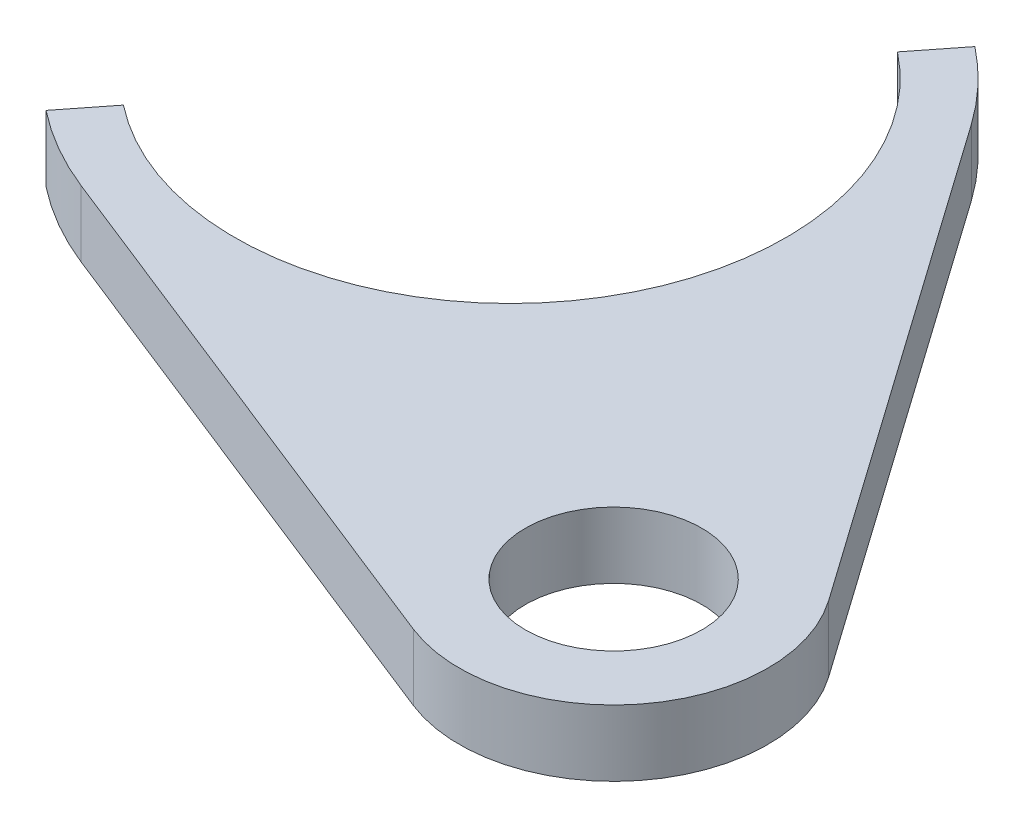
ISO-10303-21;
HEADER;
FILE_DESCRIPTION(('STEP AP214'),'2;1');
FILE_NAME('part.step','',(''),(''),'','','');
FILE_SCHEMA(('AUTOMOTIVE_DESIGN { 1 0 10303 214 1 1 1 1 }'));
ENDSEC;
DATA;
#1=APPLICATION_CONTEXT('core data for automotive mechanical design processes');
#2=APPLICATION_PROTOCOL_DEFINITION('international standard','automotive_design',2000,#1);
#3=PRODUCT_CONTEXT('',#1,'mechanical');
#4=PRODUCT('Part','Part','',(#3));
#5=PRODUCT_RELATED_PRODUCT_CATEGORY('part','',(#4));
#6=PRODUCT_DEFINITION_FORMATION('','',#4);
#7=PRODUCT_DEFINITION_CONTEXT('part definition',#1,'design');
#8=PRODUCT_DEFINITION('design','',#6,#7);
#9=PRODUCT_DEFINITION_SHAPE('','',#8);
#10=(LENGTH_UNIT() NAMED_UNIT(*) SI_UNIT(.MILLI.,.METRE.));
#11=(NAMED_UNIT(*) PLANE_ANGLE_UNIT() SI_UNIT($,.RADIAN.));
#12=(NAMED_UNIT(*) SI_UNIT($,.STERADIAN.) SOLID_ANGLE_UNIT());
#13=UNCERTAINTY_MEASURE_WITH_UNIT(LENGTH_MEASURE(1.E-05),#10,'distance_accuracy_value','');
#14=(GEOMETRIC_REPRESENTATION_CONTEXT(3) GLOBAL_UNCERTAINTY_ASSIGNED_CONTEXT((#13)) GLOBAL_UNIT_ASSIGNED_CONTEXT((#10,
#11,#12)) REPRESENTATION_CONTEXT('',''));
#15=CARTESIAN_POINT('',(0.,0.,0.));
#16=DIRECTION('',(0.,0.,1.));
#17=DIRECTION('',(1.,0.,0.));
#18=AXIS2_PLACEMENT_3D('',#15,#16,#17);
#19=CARTESIAN_POINT('',(-1685.3,3.,117.9));
#20=DIRECTION('',(0.,1.,0.));
#21=DIRECTION('',(0.,0.,1.));
#22=AXIS2_PLACEMENT_3D('',#19,#20,#21);
#23=PLANE('',#22);
#24=CARTESIAN_POINT('',(-1685.3,3.,117.9));
#25=DIRECTION('',(0.,-1.,0.));
#26=DIRECTION('',(0.,0.,1.));
#27=AXIS2_PLACEMENT_3D('',#24,#25,#26);
#28=CIRCLE('',#27,12.5);
#29=CARTESIAN_POINT('',(-1677.56763032335,3.,108.078571428571));
#30=VERTEX_POINT('',#29);
#31=CARTESIAN_POINT('',(-1693.03236967665,3.,127.721428571429));
#32=VERTEX_POINT('',#31);
#33=EDGE_CURVE('E146',#30,#32,#28,.T.);
#34=ORIENTED_EDGE('',*,*,#33,.T.);
#35=DIRECTION('',(-0.618589574131775,0.,0.78571428571426));
#36=VECTOR('',#35,1.);
#37=CARTESIAN_POINT('',(-1694.57884361198,3.,129.685714285714));
#38=LINE('',#37,#36);
#39=CARTESIAN_POINT('',(-1694.57884361198,3.,129.685714285714));
#40=VERTEX_POINT('',#39);
#41=EDGE_CURVE('E94',#32,#40,#38,.T.);
#42=ORIENTED_EDGE('',*,*,#41,.T.);
#43=CARTESIAN_POINT('',(-1685.3,3.,117.9));
#44=DIRECTION('',(0.,1.,0.));
#45=DIRECTION('',(0.,0.,1.));
#46=AXIS2_PLACEMENT_3D('',#43,#44,#45);
#47=CIRCLE('',#46,15.);
#48=CARTESIAN_POINT('',(-1690.82470666221,3.,131.845523163242));
#49=VERTEX_POINT('',#48);
#50=EDGE_CURVE('E161',#40,#49,#47,.T.);
#51=ORIENTED_EDGE('',*,*,#50,.T.);
#52=DIRECTION('',(0.929701544216142,0.,0.368313777480726));
#53=VECTOR('',#52,1.);
#54=CARTESIAN_POINT('',(-1665.87819644236,3.,141.728418885202));
#55=LINE('',#54,#53);
#56=CARTESIAN_POINT('',(-1665.87819644236,3.,141.728418885202));
#57=VERTEX_POINT('',#56);
#58=EDGE_CURVE('E174',#49,#57,#55,.T.);
#59=ORIENTED_EDGE('',*,*,#58,.T.);
#60=CARTESIAN_POINT('',(-1663.3,3.,135.220508075689));
#61=DIRECTION('',(0.,1.,0.));
#62=DIRECTION('',(0.,0.,1.));
#63=AXIS2_PLACEMENT_3D('',#60,#61,#62);
#64=CIRCLE('',#63,7.00000000000009);
#65=CARTESIAN_POINT('',(-1657.57894641478,3.,131.186955562703));
#66=VERTEX_POINT('',#65);
#67=EDGE_CURVE('E113',#57,#66,#64,.T.);
#68=ORIENTED_EDGE('',*,*,#67,.T.);
#69=DIRECTION('',(-0.576221787569432,0.,-0.817293369317461));
#70=VECTOR('',#69,1.);
#71=CARTESIAN_POINT('',(-1673.04059946024,3.,109.256673186458));
#72=LINE('',#71,#70);
#73=CARTESIAN_POINT('',(-1673.04059946024,3.,109.256673186458));
#74=VERTEX_POINT('',#73);
#75=EDGE_CURVE('E107',#66,#74,#72,.T.);
#76=ORIENTED_EDGE('',*,*,#75,.T.);
#77=CARTESIAN_POINT('',(-1685.3,3.,117.9));
#78=DIRECTION('',(0.,1.,0.));
#79=DIRECTION('',(0.,0.,1.));
#80=AXIS2_PLACEMENT_3D('',#77,#78,#79);
#81=CIRCLE('',#80,15.0000000000001);
#82=CARTESIAN_POINT('',(-1676.02115638802,3.,106.114285714286));
#83=VERTEX_POINT('',#82);
#84=EDGE_CURVE('E111',#74,#83,#81,.T.);
#85=ORIENTED_EDGE('',*,*,#84,.T.);
#86=DIRECTION('',(-0.618589574131788,0.,0.785714285714249));
#87=VECTOR('',#86,1.);
#88=CARTESIAN_POINT('',(-1677.56763032335,3.,108.078571428571));
#89=LINE('',#88,#87);
#90=EDGE_CURVE('E51',#83,#30,#89,.T.);
#91=ORIENTED_EDGE('',*,*,#90,.T.);
#92=EDGE_LOOP('',(#34,#42,#51,#59,#68,#76,#85,#91));
#93=FACE_BOUND('',#92,.T.);
#94=CARTESIAN_POINT('',(-1663.3,3.,135.220508075689));
#95=DIRECTION('',(0.,1.,0.));
#96=DIRECTION('',(0.,0.,1.));
#97=AXIS2_PLACEMENT_3D('',#94,#95,#96);
#98=CIRCLE('',#97,3.99999999999999);
#99=CARTESIAN_POINT('',(-1663.3,3.,139.220508075689));
#100=VERTEX_POINT('',#99);
#101=EDGE_CURVE('E135',#100,#100,#98,.T.);
#102=ORIENTED_EDGE('',*,*,#101,.F.);
#103=EDGE_LOOP('',(#102));
#104=FACE_BOUND('',#103,.T.);
#105=ADVANCED_FACE('F34',(#93,#104),#23,.T.);
#106=CARTESIAN_POINT('',(-1685.3,0.,117.9));
#107=DIRECTION('',(0.,1.,0.));
#108=DIRECTION('',(0.,0.,1.));
#109=AXIS2_PLACEMENT_3D('',#106,#107,#108);
#110=PLANE('',#109);
#111=CARTESIAN_POINT('',(-1685.3,0.,117.9));
#112=DIRECTION('',(0.,-1.,0.));
#113=DIRECTION('',(0.,0.,1.));
#114=AXIS2_PLACEMENT_3D('',#111,#112,#113);
#115=CIRCLE('',#114,12.5);
#116=CARTESIAN_POINT('',(-1677.56763032335,0.,108.078571428571));
#117=VERTEX_POINT('',#116);
#118=CARTESIAN_POINT('',(-1693.03236967665,0.,127.721428571429));
#119=VERTEX_POINT('',#118);
#120=EDGE_CURVE('E131',#117,#119,#115,.T.);
#121=ORIENTED_EDGE('',*,*,#120,.F.);
#122=DIRECTION('',(-0.618589574131788,0.,0.785714285714249));
#123=VECTOR('',#122,1.);
#124=CARTESIAN_POINT('',(-1677.56763032335,0.,108.078571428571));
#125=LINE('',#124,#123);
#126=CARTESIAN_POINT('',(-1676.02115638802,0.,106.114285714286));
#127=VERTEX_POINT('',#126);
#128=EDGE_CURVE('E86',#127,#117,#125,.T.);
#129=ORIENTED_EDGE('',*,*,#128,.F.);
#130=CARTESIAN_POINT('',(-1685.3,0.,117.9));
#131=DIRECTION('',(0.,1.,0.));
#132=DIRECTION('',(0.,0.,1.));
#133=AXIS2_PLACEMENT_3D('',#130,#131,#132);
#134=CIRCLE('',#133,15.0000000000001);
#135=CARTESIAN_POINT('',(-1673.04059946024,0.,109.256673186458));
#136=VERTEX_POINT('',#135);
#137=EDGE_CURVE('E80',#136,#127,#134,.T.);
#138=ORIENTED_EDGE('',*,*,#137,.F.);
#139=DIRECTION('',(-0.576221787569432,0.,-0.817293369317461));
#140=VECTOR('',#139,1.);
#141=CARTESIAN_POINT('',(-1673.04059946024,0.,109.256673186458));
#142=LINE('',#141,#140);
#143=CARTESIAN_POINT('',(-1657.57894641478,0.,131.186955562703));
#144=VERTEX_POINT('',#143);
#145=EDGE_CURVE('E121',#144,#136,#142,.T.);
#146=ORIENTED_EDGE('',*,*,#145,.F.);
#147=CARTESIAN_POINT('',(-1663.3,0.,135.220508075689));
#148=DIRECTION('',(0.,1.,0.));
#149=DIRECTION('',(0.,0.,1.));
#150=AXIS2_PLACEMENT_3D('',#147,#148,#149);
#151=CIRCLE('',#150,7.00000000000009);
#152=CARTESIAN_POINT('',(-1665.87819644236,0.,141.728418885202));
#153=VERTEX_POINT('',#152);
#154=EDGE_CURVE('E141',#153,#144,#151,.T.);
#155=ORIENTED_EDGE('',*,*,#154,.F.);
#156=DIRECTION('',(0.929701544216142,0.,0.368313777480726));
#157=VECTOR('',#156,1.);
#158=CARTESIAN_POINT('',(-1665.87819644236,0.,141.728418885202));
#159=LINE('',#158,#157);
#160=CARTESIAN_POINT('',(-1690.82470666221,0.,131.845523163242));
#161=VERTEX_POINT('',#160);
#162=EDGE_CURVE('E139',#161,#153,#159,.T.);
#163=ORIENTED_EDGE('',*,*,#162,.F.);
#164=CARTESIAN_POINT('',(-1685.3,0.,117.9));
#165=DIRECTION('',(0.,1.,0.));
#166=DIRECTION('',(0.,0.,1.));
#167=AXIS2_PLACEMENT_3D('',#164,#165,#166);
#168=CIRCLE('',#167,15.);
#169=CARTESIAN_POINT('',(-1694.57884361198,0.,129.685714285714));
#170=VERTEX_POINT('',#169);
#171=EDGE_CURVE('E137',#170,#161,#168,.T.);
#172=ORIENTED_EDGE('',*,*,#171,.F.);
#173=DIRECTION('',(-0.618589574131775,0.,0.78571428571426));
#174=VECTOR('',#173,1.);
#175=CARTESIAN_POINT('',(-1694.57884361198,0.,129.685714285714));
#176=LINE('',#175,#174);
#177=EDGE_CURVE('E134',#119,#170,#176,.T.);
#178=ORIENTED_EDGE('',*,*,#177,.F.);
#179=EDGE_LOOP('',(#121,#129,#138,#146,#155,#163,#172,#178));
#180=FACE_BOUND('',#179,.T.);
#181=CARTESIAN_POINT('',(-1663.3,0.,135.220508075689));
#182=DIRECTION('',(0.,1.,0.));
#183=DIRECTION('',(0.,0.,1.));
#184=AXIS2_PLACEMENT_3D('',#181,#182,#183);
#185=CIRCLE('',#184,3.99999999999999);
#186=CARTESIAN_POINT('',(-1663.3,0.,139.220508075689));
#187=VERTEX_POINT('',#186);
#188=EDGE_CURVE('E180',#187,#187,#185,.T.);
#189=ORIENTED_EDGE('',*,*,#188,.T.);
#190=EDGE_LOOP('',(#189));
#191=FACE_BOUND('',#190,.T.);
#192=ADVANCED_FACE('F165',(#180,#191),#110,.F.);
#193=CARTESIAN_POINT('',(-1685.3,3.,117.9));
#194=DIRECTION('',(0.,-1.,0.));
#195=DIRECTION('',(0.,0.,-1.));
#196=AXIS2_PLACEMENT_3D('',#193,#194,#195);
#197=CYLINDRICAL_SURFACE('',#196,12.5);
#198=ORIENTED_EDGE('',*,*,#120,.T.);
#199=DIRECTION('',(0.,-1.,0.));
#200=VECTOR('',#199,1.);
#201=CARTESIAN_POINT('',(-1693.03236967665,3.,127.721428571429));
#202=LINE('',#201,#200);
#203=EDGE_CURVE('E11',#32,#119,#202,.T.);
#204=ORIENTED_EDGE('',*,*,#203,.F.);
#205=ORIENTED_EDGE('',*,*,#33,.F.);
#206=DIRECTION('',(0.,-1.,0.));
#207=VECTOR('',#206,1.);
#208=CARTESIAN_POINT('',(-1677.56763032335,3.,108.078571428571));
#209=LINE('',#208,#207);
#210=EDGE_CURVE('E127',#30,#117,#209,.T.);
#211=ORIENTED_EDGE('',*,*,#210,.T.);
#212=EDGE_LOOP('',(#198,#204,#205,#211));
#213=FACE_BOUND('',#212,.T.);
#214=ADVANCED_FACE('F36',(#213),#197,.F.);
#215=CARTESIAN_POINT('',(-1694.57884361198,3.,129.685714285714));
#216=DIRECTION('',(0.78571428571426,0.,0.618589574131775));
#217=DIRECTION('',(0.618589574131775,0.,-0.78571428571426));
#218=AXIS2_PLACEMENT_3D('',#215,#216,#217);
#219=PLANE('',#218);
#220=ORIENTED_EDGE('',*,*,#177,.T.);
#221=DIRECTION('',(0.,-1.,0.));
#222=VECTOR('',#221,1.);
#223=CARTESIAN_POINT('',(-1694.57884361198,3.,129.685714285714));
#224=LINE('',#223,#222);
#225=EDGE_CURVE('E43',#40,#170,#224,.T.);
#226=ORIENTED_EDGE('',*,*,#225,.F.);
#227=ORIENTED_EDGE('',*,*,#41,.F.);
#228=ORIENTED_EDGE('',*,*,#203,.T.);
#229=EDGE_LOOP('',(#220,#226,#227,#228));
#230=FACE_BOUND('',#229,.T.);
#231=ADVANCED_FACE('F208',(#230),#219,.F.);
#232=CARTESIAN_POINT('',(-1685.3,3.,117.9));
#233=DIRECTION('',(0.,-1.,0.));
#234=DIRECTION('',(0.,0.,-1.));
#235=AXIS2_PLACEMENT_3D('',#232,#233,#234);
#236=CYLINDRICAL_SURFACE('',#235,15.);
#237=ORIENTED_EDGE('',*,*,#171,.T.);
#238=DIRECTION('',(0.,-1.,0.));
#239=VECTOR('',#238,1.);
#240=CARTESIAN_POINT('',(-1690.82470666221,3.,131.845523163242));
#241=LINE('',#240,#239);
#242=EDGE_CURVE('E153',#49,#161,#241,.T.);
#243=ORIENTED_EDGE('',*,*,#242,.F.);
#244=ORIENTED_EDGE('',*,*,#50,.F.);
#245=ORIENTED_EDGE('',*,*,#225,.T.);
#246=EDGE_LOOP('',(#237,#243,#244,#245));
#247=FACE_BOUND('',#246,.T.);
#248=ADVANCED_FACE('F159',(#247),#236,.T.);
#249=CARTESIAN_POINT('',(-1665.87819644236,3.,141.728418885202));
#250=DIRECTION('',(0.368313777480726,0.,-0.929701544216142));
#251=DIRECTION('',(-0.929701544216142,0.,-0.368313777480726));
#252=AXIS2_PLACEMENT_3D('',#249,#250,#251);
#253=PLANE('',#252);
#254=ORIENTED_EDGE('',*,*,#162,.T.);
#255=DIRECTION('',(0.,-1.,0.));
#256=VECTOR('',#255,1.);
#257=CARTESIAN_POINT('',(-1665.87819644236,3.,141.728418885202));
#258=LINE('',#257,#256);
#259=EDGE_CURVE('E150',#57,#153,#258,.T.);
#260=ORIENTED_EDGE('',*,*,#259,.F.);
#261=ORIENTED_EDGE('',*,*,#58,.F.);
#262=ORIENTED_EDGE('',*,*,#242,.T.);
#263=EDGE_LOOP('',(#254,#260,#261,#262));
#264=FACE_BOUND('',#263,.T.);
#265=ADVANCED_FACE('F170',(#264),#253,.F.);
#266=CARTESIAN_POINT('',(-1663.3,3.,135.220508075689));
#267=DIRECTION('',(0.,-1.,0.));
#268=DIRECTION('',(0.,0.,-1.));
#269=AXIS2_PLACEMENT_3D('',#266,#267,#268);
#270=CYLINDRICAL_SURFACE('',#269,7.00000000000009);
#271=ORIENTED_EDGE('',*,*,#154,.T.);
#272=DIRECTION('',(0.,-1.,0.));
#273=VECTOR('',#272,1.);
#274=CARTESIAN_POINT('',(-1657.57894641478,3.,131.186955562703));
#275=LINE('',#274,#273);
#276=EDGE_CURVE('E122',#66,#144,#275,.T.);
#277=ORIENTED_EDGE('',*,*,#276,.F.);
#278=ORIENTED_EDGE('',*,*,#67,.F.);
#279=ORIENTED_EDGE('',*,*,#259,.T.);
#280=EDGE_LOOP('',(#271,#277,#278,#279));
#281=FACE_BOUND('',#280,.T.);
#282=ADVANCED_FACE('F173',(#281),#270,.T.);
#283=CARTESIAN_POINT('',(-1673.04059946024,3.,109.256673186458));
#284=DIRECTION('',(-0.817293369317461,0.,0.576221787569432));
#285=DIRECTION('',(0.576221787569432,0.,0.817293369317461));
#286=AXIS2_PLACEMENT_3D('',#283,#284,#285);
#287=PLANE('',#286);
#288=ORIENTED_EDGE('',*,*,#145,.T.);
#289=DIRECTION('',(0.,-1.,0.));
#290=VECTOR('',#289,1.);
#291=CARTESIAN_POINT('',(-1673.04059946024,3.,109.256673186458));
#292=LINE('',#291,#290);
#293=EDGE_CURVE('E118',#74,#136,#292,.T.);
#294=ORIENTED_EDGE('',*,*,#293,.F.);
#295=ORIENTED_EDGE('',*,*,#75,.F.);
#296=ORIENTED_EDGE('',*,*,#276,.T.);
#297=EDGE_LOOP('',(#288,#294,#295,#296));
#298=FACE_BOUND('',#297,.T.);
#299=ADVANCED_FACE('F119',(#298),#287,.F.);
#300=CARTESIAN_POINT('',(-1685.3,3.,117.9));
#301=DIRECTION('',(0.,-1.,0.));
#302=DIRECTION('',(0.,0.,-1.));
#303=AXIS2_PLACEMENT_3D('',#300,#301,#302);
#304=CYLINDRICAL_SURFACE('',#303,15.0000000000001);
#305=ORIENTED_EDGE('',*,*,#137,.T.);
#306=DIRECTION('',(0.,-1.,0.));
#307=VECTOR('',#306,1.);
#308=CARTESIAN_POINT('',(-1676.02115638802,3.,106.114285714286));
#309=LINE('',#308,#307);
#310=EDGE_CURVE('E123',#83,#127,#309,.T.);
#311=ORIENTED_EDGE('',*,*,#310,.F.);
#312=ORIENTED_EDGE('',*,*,#84,.F.);
#313=ORIENTED_EDGE('',*,*,#293,.T.);
#314=EDGE_LOOP('',(#305,#311,#312,#313));
#315=FACE_BOUND('',#314,.T.);
#316=ADVANCED_FACE('F125',(#315),#304,.T.);
#317=CARTESIAN_POINT('',(-1677.56763032335,3.,108.078571428571));
#318=DIRECTION('',(0.785714285714249,0.,0.618589574131788));
#319=DIRECTION('',(0.618589574131788,0.,-0.785714285714249));
#320=AXIS2_PLACEMENT_3D('',#317,#318,#319);
#321=PLANE('',#320);
#322=ORIENTED_EDGE('',*,*,#128,.T.);
#323=ORIENTED_EDGE('',*,*,#210,.F.);
#324=ORIENTED_EDGE('',*,*,#90,.F.);
#325=ORIENTED_EDGE('',*,*,#310,.T.);
#326=EDGE_LOOP('',(#322,#323,#324,#325));
#327=FACE_BOUND('',#326,.T.);
#328=ADVANCED_FACE('F196',(#327),#321,.F.);
#329=CARTESIAN_POINT('',(-1663.3,3.,135.220508075689));
#330=DIRECTION('',(0.,-1.,0.));
#331=DIRECTION('',(0.,0.,-1.));
#332=AXIS2_PLACEMENT_3D('',#329,#330,#331);
#333=CYLINDRICAL_SURFACE('',#332,3.99999999999999);
#334=ORIENTED_EDGE('',*,*,#101,.T.);
#335=EDGE_LOOP('',(#334));
#336=FACE_BOUND('',#335,.T.);
#337=ORIENTED_EDGE('',*,*,#188,.F.);
#338=EDGE_LOOP('',(#337));
#339=FACE_BOUND('',#338,.T.);
#340=ADVANCED_FACE('F186',(#336,#339),#333,.F.);
#341=CLOSED_SHELL('',(#105,#192,#214,#231,#248,#265,#282,#299,#316,#328,#340));
#342=MANIFOLD_SOLID_BREP('B2',#341);
#343=ADVANCED_BREP_SHAPE_REPRESENTATION('',(#18,#342),#14);
#344=SHAPE_DEFINITION_REPRESENTATION(#9,#343);
ENDSEC;
END-ISO-10303-21;
